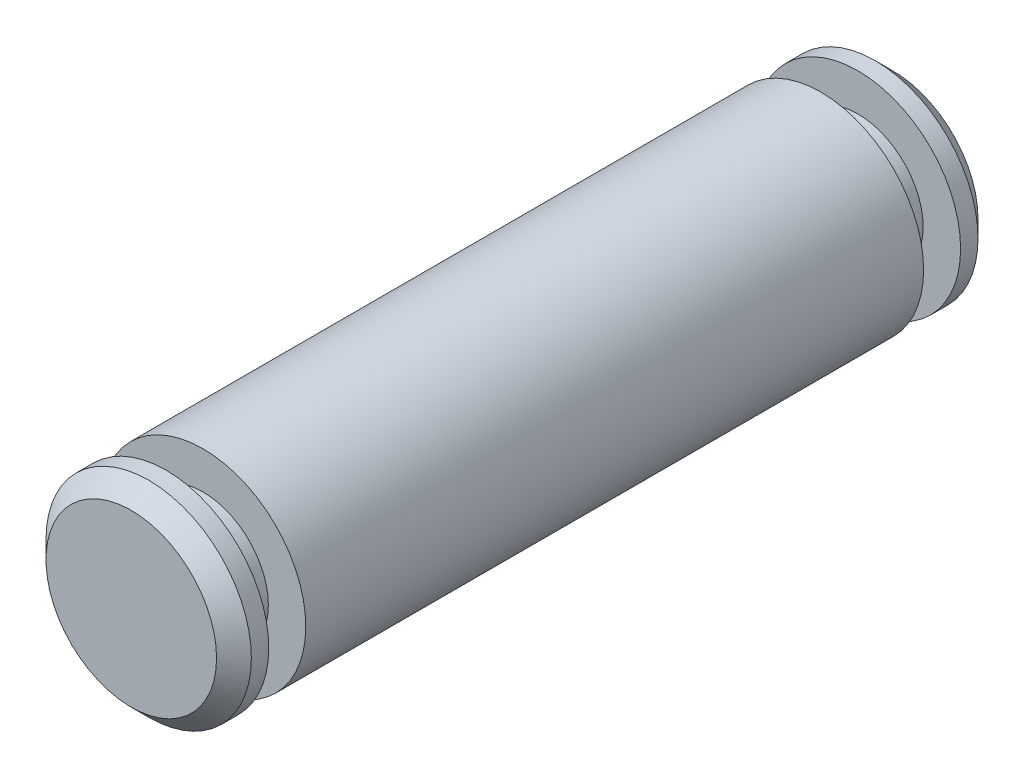
ISO-10303-21;
HEADER;
FILE_DESCRIPTION(('STEP AP214'),'2;1');
FILE_NAME('part.step','',(''),(''),'','','');
FILE_SCHEMA(('AUTOMOTIVE_DESIGN { 1 0 10303 214 1 1 1 1 }'));
ENDSEC;
DATA;
#1=APPLICATION_CONTEXT('core data for automotive mechanical design processes');
#2=APPLICATION_PROTOCOL_DEFINITION('international standard','automotive_design',2000,#1);
#3=PRODUCT_CONTEXT('',#1,'mechanical');
#4=PRODUCT('Part','Part','',(#3));
#5=PRODUCT_RELATED_PRODUCT_CATEGORY('part','',(#4));
#6=PRODUCT_DEFINITION_FORMATION('','',#4);
#7=PRODUCT_DEFINITION_CONTEXT('part definition',#1,'design');
#8=PRODUCT_DEFINITION('design','',#6,#7);
#9=PRODUCT_DEFINITION_SHAPE('','',#8);
#10=(LENGTH_UNIT() NAMED_UNIT(*) SI_UNIT(.MILLI.,.METRE.));
#11=(NAMED_UNIT(*) PLANE_ANGLE_UNIT() SI_UNIT($,.RADIAN.));
#12=(NAMED_UNIT(*) SI_UNIT($,.STERADIAN.) SOLID_ANGLE_UNIT());
#13=UNCERTAINTY_MEASURE_WITH_UNIT(LENGTH_MEASURE(1.E-05),#10,'distance_accuracy_value','');
#14=(GEOMETRIC_REPRESENTATION_CONTEXT(3) GLOBAL_UNCERTAINTY_ASSIGNED_CONTEXT((#13)) GLOBAL_UNIT_ASSIGNED_CONTEXT((#10,
#11,#12)) REPRESENTATION_CONTEXT('',''));
#15=CARTESIAN_POINT('',(0.,0.,0.));
#16=DIRECTION('',(0.,0.,1.));
#17=DIRECTION('',(1.,0.,0.));
#18=AXIS2_PLACEMENT_3D('',#15,#16,#17);
#19=CARTESIAN_POINT('',(0.,0.,5.55625));
#20=DIRECTION('',(0.,0.,-0.999999999999994));
#21=DIRECTION('',(-1.00000000000001,0.,0.));
#22=AXIS2_PLACEMENT_3D('',#19,#20,#21);
#23=CYLINDRICAL_SURFACE('',#22,1.4986);
#24=CARTESIAN_POINT('',(0.,0.,-4.5082499999998));
#25=DIRECTION('',(0.,0.,0.999999999999994));
#26=DIRECTION('',(1.00000000000001,0.,0.));
#27=AXIS2_PLACEMENT_3D('',#24,#25,#26);
#28=CIRCLE('',#27,1.4986);
#29=CARTESIAN_POINT('',(1.49859999999998,0.,-4.5082499999998));
#30=VERTEX_POINT('',#29);
#31=EDGE_CURVE('E74',#30,#30,#28,.T.);
#32=ORIENTED_EDGE('',*,*,#31,.T.);
#33=EDGE_LOOP('',(#32));
#34=FACE_BOUND('',#33,.T.);
#35=CARTESIAN_POINT('',(-1.52655665885959E-13,0.,4.50825000000001));
#36=DIRECTION('',(0.,0.,0.999999999999994));
#37=DIRECTION('',(1.00000000000001,0.,0.));
#38=AXIS2_PLACEMENT_3D('',#35,#36,#37);
#39=CIRCLE('',#38,1.4986);
#40=CARTESIAN_POINT('',(1.49859999999986,0.,4.50825000000001));
#41=VERTEX_POINT('',#40);
#42=EDGE_CURVE('E66',#41,#41,#39,.T.);
#43=ORIENTED_EDGE('',*,*,#42,.F.);
#44=EDGE_LOOP('',(#43));
#45=FACE_BOUND('',#44,.T.);
#46=ADVANCED_FACE('F32',(#34,#45),#23,.T.);
#47=CARTESIAN_POINT('',(0.,0.,5.30224999999999));
#48=DIRECTION('',(0.,0.,0.999999999999994));
#49=DIRECTION('',(1.00000000000001,0.,0.));
#50=AXIS2_PLACEMENT_3D('',#47,#48,#49);
#51=CIRCLE('',#50,1.4986);
#52=CARTESIAN_POINT('',(1.49860000000004,0.,5.30224999999999));
#53=VERTEX_POINT('',#52);
#54=EDGE_CURVE('E10',#53,#53,#51,.F.);
#55=ORIENTED_EDGE('',*,*,#54,.T.);
#56=EDGE_LOOP('',(#55));
#57=FACE_BOUND('',#56,.T.);
#58=CARTESIAN_POINT('',(0.,0.,5.04825));
#59=DIRECTION('',(0.,0.,0.999999999999994));
#60=DIRECTION('',(1.00000000000001,0.,0.));
#61=AXIS2_PLACEMENT_3D('',#58,#59,#60);
#62=CIRCLE('',#61,1.4986);
#63=CARTESIAN_POINT('',(1.49860000000004,0.,5.04825));
#64=VERTEX_POINT('',#63);
#65=EDGE_CURVE('E70',#64,#64,#62,.T.);
#66=ORIENTED_EDGE('',*,*,#65,.T.);
#67=EDGE_LOOP('',(#66));
#68=FACE_BOUND('',#67,.T.);
#69=ADVANCED_FACE('F100',(#57,#68),#23,.T.);
#70=CARTESIAN_POINT('',(0.,0.,5.55625));
#71=DIRECTION('',(0.,0.,0.999999999999994));
#72=DIRECTION('',(1.00000000000001,0.,0.));
#73=AXIS2_PLACEMENT_3D('',#70,#71,#72);
#74=PLANE('',#73);
#75=CARTESIAN_POINT('',(0.,0.,5.55625));
#76=DIRECTION('',(0.,0.,0.999999999999994));
#77=DIRECTION('',(1.00000000000001,0.,0.));
#78=AXIS2_PLACEMENT_3D('',#75,#76,#77);
#79=CIRCLE('',#78,1.2446);
#80=CARTESIAN_POINT('',(1.24460000000003,0.,5.55625));
#81=VERTEX_POINT('',#80);
#82=EDGE_CURVE('E40',#81,#81,#79,.T.);
#83=ORIENTED_EDGE('',*,*,#82,.T.);
#84=EDGE_LOOP('',(#83));
#85=FACE_BOUND('',#84,.T.);
#86=ADVANCED_FACE('F111',(#85),#74,.T.);
#87=CARTESIAN_POINT('',(0.,-1.49859999999993,5.04825));
#88=DIRECTION('',(0.,0.,0.999999999999994));
#89=DIRECTION('',(1.00000000000001,0.,0.));
#90=AXIS2_PLACEMENT_3D('',#87,#88,#89);
#91=PLANE('',#90);
#92=ORIENTED_EDGE('',*,*,#65,.F.);
#93=EDGE_LOOP('',(#92));
#94=FACE_BOUND('',#93,.T.);
#95=CARTESIAN_POINT('',(0.,0.,5.04825));
#96=DIRECTION('',(0.,0.,0.999999999999994));
#97=DIRECTION('',(1.00000000000001,0.,0.));
#98=AXIS2_PLACEMENT_3D('',#95,#96,#97);
#99=CIRCLE('',#98,0.9525);
#100=CARTESIAN_POINT('',(0.95250000000003,0.,5.04825));
#101=VERTEX_POINT('',#100);
#102=EDGE_CURVE('E58',#101,#101,#99,.T.);
#103=ORIENTED_EDGE('',*,*,#102,.T.);
#104=EDGE_LOOP('',(#103));
#105=FACE_BOUND('',#104,.T.);
#106=ADVANCED_FACE('F115',(#94,#105),#91,.F.);
#107=CARTESIAN_POINT('',(0.,0.,8.82803245544554));
#108=DIRECTION('',(0.,0.,0.999999999999994));
#109=DIRECTION('',(1.00000000000001,0.,0.));
#110=AXIS2_PLACEMENT_3D('',#107,#108,#109);
#111=CYLINDRICAL_SURFACE('',#110,0.9525);
#112=ORIENTED_EDGE('',*,*,#102,.F.);
#113=EDGE_LOOP('',(#112));
#114=FACE_BOUND('',#113,.T.);
#115=CARTESIAN_POINT('',(-1.52655665885959E-13,0.,4.50825000000001));
#116=DIRECTION('',(0.,0.,0.999999999999994));
#117=DIRECTION('',(1.00000000000001,0.,0.));
#118=AXIS2_PLACEMENT_3D('',#115,#116,#117);
#119=CIRCLE('',#118,0.9525);
#120=CARTESIAN_POINT('',(0.952499999999857,0.,4.50825000000001));
#121=VERTEX_POINT('',#120);
#122=EDGE_CURVE('E62',#121,#121,#119,.T.);
#123=ORIENTED_EDGE('',*,*,#122,.T.);
#124=EDGE_LOOP('',(#123));
#125=FACE_BOUND('',#124,.T.);
#126=ADVANCED_FACE('F122',(#114,#125),#111,.T.);
#127=CARTESIAN_POINT('',(-1.28369537222284E-13,-1.49860000000006,4.50825000000001));
#128=DIRECTION('',(0.,0.,-0.999999999999994));
#129=DIRECTION('',(-1.00000000000001,0.,0.));
#130=AXIS2_PLACEMENT_3D('',#127,#128,#129);
#131=PLANE('',#130);
#132=ORIENTED_EDGE('',*,*,#122,.F.);
#133=EDGE_LOOP('',(#132));
#134=FACE_BOUND('',#133,.T.);
#135=ORIENTED_EDGE('',*,*,#42,.T.);
#136=EDGE_LOOP('',(#135));
#137=FACE_BOUND('',#136,.T.);
#138=ADVANCED_FACE('F128',(#134,#137),#131,.F.);
#139=CARTESIAN_POINT('',(0.,-1.4986,-4.5082499999998));
#140=DIRECTION('',(0.,0.,0.999999999999994));
#141=DIRECTION('',(1.00000000000001,0.,0.));
#142=AXIS2_PLACEMENT_3D('',#139,#140,#141);
#143=PLANE('',#142);
#144=ORIENTED_EDGE('',*,*,#31,.F.);
#145=EDGE_LOOP('',(#144));
#146=FACE_BOUND('',#145,.T.);
#147=CARTESIAN_POINT('',(0.,0.,-4.5082499999998));
#148=DIRECTION('',(0.,0.,0.999999999999994));
#149=DIRECTION('',(1.00000000000001,0.,0.));
#150=AXIS2_PLACEMENT_3D('',#147,#148,#149);
#151=CIRCLE('',#150,0.952499999999999);
#152=CARTESIAN_POINT('',(0.95249999999997,0.,-4.5082499999998));
#153=VERTEX_POINT('',#152);
#154=EDGE_CURVE('E78',#153,#153,#151,.T.);
#155=ORIENTED_EDGE('',*,*,#154,.T.);
#156=EDGE_LOOP('',(#155));
#157=FACE_BOUND('',#156,.T.);
#158=ADVANCED_FACE('F134',(#146,#157),#143,.F.);
#159=CARTESIAN_POINT('',(0.,0.,8.82803245544554));
#160=DIRECTION('',(0.,0.,0.999999999999994));
#161=DIRECTION('',(1.00000000000001,0.,0.));
#162=AXIS2_PLACEMENT_3D('',#159,#160,#161);
#163=CYLINDRICAL_SURFACE('',#162,0.952499999999999);
#164=ORIENTED_EDGE('',*,*,#154,.F.);
#165=EDGE_LOOP('',(#164));
#166=FACE_BOUND('',#165,.T.);
#167=CARTESIAN_POINT('',(0.,0.,-5.0482499999998));
#168=DIRECTION('',(0.,0.,0.999999999999994));
#169=DIRECTION('',(1.00000000000001,0.,0.));
#170=AXIS2_PLACEMENT_3D('',#167,#168,#169);
#171=CIRCLE('',#170,0.952499999999999);
#172=CARTESIAN_POINT('',(0.952499999999977,0.,-5.0482499999998));
#173=VERTEX_POINT('',#172);
#174=EDGE_CURVE('E82',#173,#173,#171,.T.);
#175=ORIENTED_EDGE('',*,*,#174,.T.);
#176=EDGE_LOOP('',(#175));
#177=FACE_BOUND('',#176,.T.);
#178=ADVANCED_FACE('F141',(#166,#177),#163,.T.);
#179=CARTESIAN_POINT('',(0.,-1.4986,-5.0482499999998));
#180=DIRECTION('',(0.,0.,-0.999999999999994));
#181=DIRECTION('',(-1.00000000000001,0.,0.));
#182=AXIS2_PLACEMENT_3D('',#179,#180,#181);
#183=PLANE('',#182);
#184=ORIENTED_EDGE('',*,*,#174,.F.);
#185=EDGE_LOOP('',(#184));
#186=FACE_BOUND('',#185,.T.);
#187=CARTESIAN_POINT('',(0.,0.,-5.0482499999998));
#188=DIRECTION('',(0.,0.,0.999999999999994));
#189=DIRECTION('',(1.00000000000001,0.,0.));
#190=AXIS2_PLACEMENT_3D('',#187,#188,#189);
#191=CIRCLE('',#190,1.4986);
#192=CARTESIAN_POINT('',(1.49859999999998,0.,-5.0482499999998));
#193=VERTEX_POINT('',#192);
#194=EDGE_CURVE('E86',#193,#193,#191,.T.);
#195=ORIENTED_EDGE('',*,*,#194,.T.);
#196=EDGE_LOOP('',(#195));
#197=FACE_BOUND('',#196,.T.);
#198=ADVANCED_FACE('F92',(#186,#197),#183,.F.);
#199=CARTESIAN_POINT('',(0.,0.,-5.5562499999998));
#200=DIRECTION('',(0.,0.,0.999999999999994));
#201=DIRECTION('',(1.00000000000001,0.,0.));
#202=AXIS2_PLACEMENT_3D('',#199,#200,#201);
#203=PLANE('',#202);
#204=CARTESIAN_POINT('',(0.,0.,-5.5562499999998));
#205=DIRECTION('',(0.,0.,0.999999999999994));
#206=DIRECTION('',(1.00000000000001,0.,0.));
#207=AXIS2_PLACEMENT_3D('',#204,#205,#206);
#208=CIRCLE('',#207,1.2446);
#209=CARTESIAN_POINT('',(1.24459999999998,0.,-5.5562499999998));
#210=VERTEX_POINT('',#209);
#211=EDGE_CURVE('E46',#210,#210,#208,.F.);
#212=ORIENTED_EDGE('',*,*,#211,.T.);
#213=EDGE_LOOP('',(#212));
#214=FACE_BOUND('',#213,.T.);
#215=ADVANCED_FACE('F97',(#214),#203,.F.);
#216=CARTESIAN_POINT('',(0.,0.,-5.3022499999998));
#217=DIRECTION('',(0.,0.,0.999999999999994));
#218=DIRECTION('',(1.00000000000001,0.,0.));
#219=AXIS2_PLACEMENT_3D('',#216,#217,#218);
#220=CIRCLE('',#219,1.4986);
#221=CARTESIAN_POINT('',(1.49859999999998,0.,-5.3022499999998));
#222=VERTEX_POINT('',#221);
#223=EDGE_CURVE('E52',#222,#222,#220,.T.);
#224=ORIENTED_EDGE('',*,*,#223,.T.);
#225=EDGE_LOOP('',(#224));
#226=FACE_BOUND('',#225,.T.);
#227=ORIENTED_EDGE('',*,*,#194,.F.);
#228=EDGE_LOOP('',(#227));
#229=FACE_BOUND('',#228,.T.);
#230=ADVANCED_FACE('F94',(#226,#229),#23,.T.);
#231=CARTESIAN_POINT('',(0.,0.,-5.3022499999998));
#232=DIRECTION('',(0.,0.,0.999999999999994));
#233=DIRECTION('',(1.00000000000001,0.,0.));
#234=AXIS2_PLACEMENT_3D('',#231,#232,#233);
#235=CONICAL_SURFACE('',#234,1.4986,0.785398163397448);
#236=ORIENTED_EDGE('',*,*,#211,.F.);
#237=EDGE_LOOP('',(#236));
#238=FACE_BOUND('',#237,.T.);
#239=ORIENTED_EDGE('',*,*,#223,.F.);
#240=EDGE_LOOP('',(#239));
#241=FACE_BOUND('',#240,.T.);
#242=ADVANCED_FACE('F96',(#238,#241),#235,.T.);
#243=CARTESIAN_POINT('',(0.,0.,5.55625));
#244=DIRECTION('',(0.,0.,-0.999999999999994));
#245=DIRECTION('',(-1.00000000000001,0.,0.));
#246=AXIS2_PLACEMENT_3D('',#243,#244,#245);
#247=CONICAL_SURFACE('',#246,1.2446,0.785398163397448);
#248=ORIENTED_EDGE('',*,*,#54,.F.);
#249=EDGE_LOOP('',(#248));
#250=FACE_BOUND('',#249,.T.);
#251=ORIENTED_EDGE('',*,*,#82,.F.);
#252=EDGE_LOOP('',(#251));
#253=FACE_BOUND('',#252,.T.);
#254=ADVANCED_FACE('F34',(#250,#253),#247,.T.);
#255=CLOSED_SHELL('',(#46,#69,#86,#106,#126,#138,#158,#178,#198,#215,#230,#242,#254));
#256=MANIFOLD_SOLID_BREP('B2',#255);
#257=ADVANCED_BREP_SHAPE_REPRESENTATION('',(#18,#256),#14);
#258=SHAPE_DEFINITION_REPRESENTATION(#9,#257);
ENDSEC;
END-ISO-10303-21;
